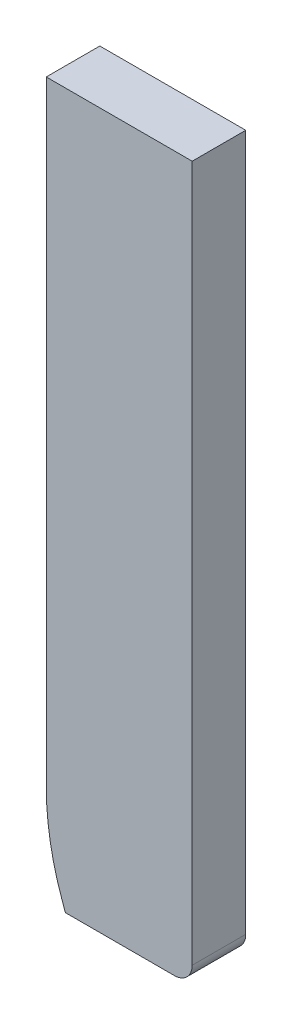
ISO-10303-21;
HEADER;
FILE_DESCRIPTION(('STEP AP214'),'2;1');
FILE_NAME('part.step','',(''),(''),'','','');
FILE_SCHEMA(('AUTOMOTIVE_DESIGN { 1 0 10303 214 1 1 1 1 }'));
ENDSEC;
DATA;
#1=APPLICATION_CONTEXT('core data for automotive mechanical design processes');
#2=APPLICATION_PROTOCOL_DEFINITION('international standard','automotive_design',2000,#1);
#3=PRODUCT_CONTEXT('',#1,'mechanical');
#4=PRODUCT('Part','Part','',(#3));
#5=PRODUCT_RELATED_PRODUCT_CATEGORY('part','',(#4));
#6=PRODUCT_DEFINITION_FORMATION('','',#4);
#7=PRODUCT_DEFINITION_CONTEXT('part definition',#1,'design');
#8=PRODUCT_DEFINITION('design','',#6,#7);
#9=PRODUCT_DEFINITION_SHAPE('','',#8);
#10=(LENGTH_UNIT() NAMED_UNIT(*) SI_UNIT(.MILLI.,.METRE.));
#11=(NAMED_UNIT(*) PLANE_ANGLE_UNIT() SI_UNIT($,.RADIAN.));
#12=(NAMED_UNIT(*) SI_UNIT($,.STERADIAN.) SOLID_ANGLE_UNIT());
#13=UNCERTAINTY_MEASURE_WITH_UNIT(LENGTH_MEASURE(1.E-05),#10,'distance_accuracy_value','');
#14=(GEOMETRIC_REPRESENTATION_CONTEXT(3) GLOBAL_UNCERTAINTY_ASSIGNED_CONTEXT((#13)) GLOBAL_UNIT_ASSIGNED_CONTEXT((#10,
#11,#12)) REPRESENTATION_CONTEXT('',''));
#15=CARTESIAN_POINT('',(0.,0.,0.));
#16=DIRECTION('',(0.,0.,1.));
#17=DIRECTION('',(1.,0.,0.));
#18=AXIS2_PLACEMENT_3D('',#15,#16,#17);
#19=CARTESIAN_POINT('',(42.8696113676581,31.0262062419554,3.));
#20=DIRECTION('',(0.,0.,-1.));
#21=DIRECTION('',(-1.,0.,0.));
#22=AXIS2_PLACEMENT_3D('',#19,#20,#21);
#23=CYLINDRICAL_SURFACE('',#22,15.0000000000003);
#24=CARTESIAN_POINT('',(42.8696113676581,31.0262062419554,0.));
#25=DIRECTION('',(0.,0.,1.));
#26=DIRECTION('',(1.,0.,0.));
#27=AXIS2_PLACEMENT_3D('',#24,#25,#26);
#28=CIRCLE('',#27,15.0000000000003);
#29=CARTESIAN_POINT('',(27.8696113676578,31.0262062419555,0.));
#30=VERTEX_POINT('',#29);
#31=CARTESIAN_POINT('',(28.7434826937352,25.9811602869831,0.));
#32=VERTEX_POINT('',#31);
#33=EDGE_CURVE('E123',#30,#32,#28,.T.);
#34=ORIENTED_EDGE('',*,*,#33,.T.);
#35=DIRECTION('',(0.,0.,-1.));
#36=VECTOR('',#35,1.);
#37=CARTESIAN_POINT('',(28.7434826937352,25.9811602869831,3.));
#38=LINE('',#37,#36);
#39=CARTESIAN_POINT('',(28.7434826937352,25.9811602869831,3.));
#40=VERTEX_POINT('',#39);
#41=EDGE_CURVE('E11',#40,#32,#38,.T.);
#42=ORIENTED_EDGE('',*,*,#41,.F.);
#43=CARTESIAN_POINT('',(42.8696113676581,31.0262062419554,3.));
#44=DIRECTION('',(0.,0.,1.));
#45=DIRECTION('',(1.,0.,0.));
#46=AXIS2_PLACEMENT_3D('',#43,#44,#45);
#47=CIRCLE('',#46,15.0000000000003);
#48=CARTESIAN_POINT('',(27.8696113676578,31.0262062419555,3.));
#49=VERTEX_POINT('',#48);
#50=EDGE_CURVE('E137',#49,#40,#47,.T.);
#51=ORIENTED_EDGE('',*,*,#50,.F.);
#52=DIRECTION('',(0.,0.,-1.));
#53=VECTOR('',#52,1.);
#54=CARTESIAN_POINT('',(27.8696113676578,31.0262062419555,3.));
#55=LINE('',#54,#53);
#56=EDGE_CURVE('E119',#49,#30,#55,.T.);
#57=ORIENTED_EDGE('',*,*,#56,.T.);
#58=EDGE_LOOP('',(#34,#42,#51,#57));
#59=FACE_BOUND('',#58,.T.);
#60=ADVANCED_FACE('F33',(#59),#23,.T.);
#61=CARTESIAN_POINT('',(28.9410399390864,25.428,3.));
#62=DIRECTION('',(0.941741911594821,0.336336396998201,0.));
#63=DIRECTION('',(-0.336336396998202,0.941741911594821,0.));
#64=AXIS2_PLACEMENT_3D('',#61,#62,#63);
#65=PLANE('',#64);
#66=DIRECTION('',(0.336336396998202,-0.941741911594821,0.));
#67=VECTOR('',#66,1.);
#68=CARTESIAN_POINT('',(28.9410399390864,25.428,0.));
#69=LINE('',#68,#67);
#70=CARTESIAN_POINT('',(28.9410399390864,25.428,0.));
#71=VERTEX_POINT('',#70);
#72=EDGE_CURVE('E126',#32,#71,#69,.T.);
#73=ORIENTED_EDGE('',*,*,#72,.T.);
#74=DIRECTION('',(0.,0.,-1.));
#75=VECTOR('',#74,1.);
#76=CARTESIAN_POINT('',(28.9410399390864,25.428,3.));
#77=LINE('',#76,#75);
#78=CARTESIAN_POINT('',(28.9410399390864,25.428,3.));
#79=VERTEX_POINT('',#78);
#80=EDGE_CURVE('E41',#79,#71,#77,.T.);
#81=ORIENTED_EDGE('',*,*,#80,.F.);
#82=DIRECTION('',(0.336336396998202,-0.941741911594821,0.));
#83=VECTOR('',#82,1.);
#84=CARTESIAN_POINT('',(28.9410399390864,25.428,3.));
#85=LINE('',#84,#83);
#86=EDGE_CURVE('E87',#40,#79,#85,.T.);
#87=ORIENTED_EDGE('',*,*,#86,.F.);
#88=ORIENTED_EDGE('',*,*,#41,.T.);
#89=EDGE_LOOP('',(#73,#81,#87,#88));
#90=FACE_BOUND('',#89,.T.);
#91=ADVANCED_FACE('F160',(#90),#65,.F.);
#92=CARTESIAN_POINT('',(35.0423886323423,25.428,3.));
#93=DIRECTION('',(0.,1.,0.));
#94=DIRECTION('',(0.,0.,1.));
#95=AXIS2_PLACEMENT_3D('',#92,#93,#94);
#96=PLANE('',#95);
#97=DIRECTION('',(1.,0.,0.));
#98=VECTOR('',#97,1.);
#99=CARTESIAN_POINT('',(35.0423886323423,25.428,0.));
#100=LINE('',#99,#98);
#101=CARTESIAN_POINT('',(35.0423886323423,25.428,0.));
#102=VERTEX_POINT('',#101);
#103=EDGE_CURVE('E128',#71,#102,#100,.T.);
#104=ORIENTED_EDGE('',*,*,#103,.T.);
#105=DIRECTION('',(0.,0.,-1.));
#106=VECTOR('',#105,1.);
#107=CARTESIAN_POINT('',(35.0423886323423,25.428,3.));
#108=LINE('',#107,#106);
#109=CARTESIAN_POINT('',(35.0423886323423,25.428,3.));
#110=VERTEX_POINT('',#109);
#111=EDGE_CURVE('E141',#110,#102,#108,.T.);
#112=ORIENTED_EDGE('',*,*,#111,.F.);
#113=DIRECTION('',(1.,0.,0.));
#114=VECTOR('',#113,1.);
#115=CARTESIAN_POINT('',(35.0423886323423,25.428,3.));
#116=LINE('',#115,#114);
#117=EDGE_CURVE('E149',#79,#110,#116,.T.);
#118=ORIENTED_EDGE('',*,*,#117,.F.);
#119=ORIENTED_EDGE('',*,*,#80,.T.);
#120=EDGE_LOOP('',(#104,#112,#118,#119));
#121=FACE_BOUND('',#120,.T.);
#122=ADVANCED_FACE('F147',(#121),#96,.F.);
#123=CARTESIAN_POINT('',(35.0423886323423,26.428,3.));
#124=DIRECTION('',(0.,0.,-1.));
#125=DIRECTION('',(-1.,0.,0.));
#126=AXIS2_PLACEMENT_3D('',#123,#124,#125);
#127=CYLINDRICAL_SURFACE('',#126,1.00000000000001);
#128=CARTESIAN_POINT('',(35.0423886323423,26.428,0.));
#129=DIRECTION('',(0.,0.,1.));
#130=DIRECTION('',(1.,0.,0.));
#131=AXIS2_PLACEMENT_3D('',#128,#129,#130);
#132=CIRCLE('',#131,1.00000000000001);
#133=CARTESIAN_POINT('',(36.0423886323423,26.428,0.));
#134=VERTEX_POINT('',#133);
#135=EDGE_CURVE('E130',#102,#134,#132,.T.);
#136=ORIENTED_EDGE('',*,*,#135,.T.);
#137=DIRECTION('',(0.,0.,-1.));
#138=VECTOR('',#137,1.);
#139=CARTESIAN_POINT('',(36.0423886323423,26.428,3.));
#140=LINE('',#139,#138);
#141=CARTESIAN_POINT('',(36.0423886323423,26.428,3.));
#142=VERTEX_POINT('',#141);
#143=EDGE_CURVE('E114',#142,#134,#140,.T.);
#144=ORIENTED_EDGE('',*,*,#143,.F.);
#145=CARTESIAN_POINT('',(35.0423886323423,26.428,3.));
#146=DIRECTION('',(0.,0.,1.));
#147=DIRECTION('',(1.,0.,0.));
#148=AXIS2_PLACEMENT_3D('',#145,#146,#147);
#149=CIRCLE('',#148,1.00000000000001);
#150=EDGE_CURVE('E104',#110,#142,#149,.T.);
#151=ORIENTED_EDGE('',*,*,#150,.F.);
#152=ORIENTED_EDGE('',*,*,#111,.T.);
#153=EDGE_LOOP('',(#136,#144,#151,#152));
#154=FACE_BOUND('',#153,.T.);
#155=ADVANCED_FACE('F153',(#154),#127,.T.);
#156=CARTESIAN_POINT('',(36.0423886323423,65.428,3.));
#157=DIRECTION('',(-1.,0.,0.));
#158=DIRECTION('',(0.,0.,1.));
#159=AXIS2_PLACEMENT_3D('',#156,#157,#158);
#160=PLANE('',#159);
#161=DIRECTION('',(0.,1.,0.));
#162=VECTOR('',#161,1.);
#163=CARTESIAN_POINT('',(36.0423886323423,65.428,0.));
#164=LINE('',#163,#162);
#165=CARTESIAN_POINT('',(36.0423886323423,65.428,0.));
#166=VERTEX_POINT('',#165);
#167=EDGE_CURVE('E112',#134,#166,#164,.T.);
#168=ORIENTED_EDGE('',*,*,#167,.T.);
#169=DIRECTION('',(0.,0.,-1.));
#170=VECTOR('',#169,1.);
#171=CARTESIAN_POINT('',(36.0423886323423,65.428,3.));
#172=LINE('',#171,#170);
#173=CARTESIAN_POINT('',(36.0423886323423,65.428,3.));
#174=VERTEX_POINT('',#173);
#175=EDGE_CURVE('E110',#174,#166,#172,.T.);
#176=ORIENTED_EDGE('',*,*,#175,.F.);
#177=DIRECTION('',(0.,1.,0.));
#178=VECTOR('',#177,1.);
#179=CARTESIAN_POINT('',(36.0423886323423,45.928,3.));
#180=LINE('',#179,#178);
#181=EDGE_CURVE('E97',#142,#174,#180,.T.);
#182=ORIENTED_EDGE('',*,*,#181,.F.);
#183=ORIENTED_EDGE('',*,*,#143,.T.);
#184=EDGE_LOOP('',(#168,#176,#182,#183));
#185=FACE_BOUND('',#184,.T.);
#186=ADVANCED_FACE('F111',(#185),#160,.F.);
#187=CARTESIAN_POINT('',(27.8696113676578,65.428,3.));
#188=DIRECTION('',(0.,-1.,0.));
#189=DIRECTION('',(0.,0.,-1.));
#190=AXIS2_PLACEMENT_3D('',#187,#188,#189);
#191=PLANE('',#190);
#192=DIRECTION('',(-1.,0.,0.));
#193=VECTOR('',#192,1.);
#194=CARTESIAN_POINT('',(27.8696113676578,65.428,0.));
#195=LINE('',#194,#193);
#196=CARTESIAN_POINT('',(27.8696113676578,65.428,0.));
#197=VERTEX_POINT('',#196);
#198=EDGE_CURVE('E134',#166,#197,#195,.T.);
#199=ORIENTED_EDGE('',*,*,#198,.T.);
#200=DIRECTION('',(0.,0.,-1.));
#201=VECTOR('',#200,1.);
#202=CARTESIAN_POINT('',(27.8696113676578,65.428,3.));
#203=LINE('',#202,#201);
#204=CARTESIAN_POINT('',(27.8696113676578,65.428,3.));
#205=VERTEX_POINT('',#204);
#206=EDGE_CURVE('E115',#205,#197,#203,.T.);
#207=ORIENTED_EDGE('',*,*,#206,.F.);
#208=DIRECTION('',(-1.,0.,0.));
#209=VECTOR('',#208,1.);
#210=CARTESIAN_POINT('',(27.8696113676578,65.428,3.));
#211=LINE('',#210,#209);
#212=EDGE_CURVE('E101',#174,#205,#211,.T.);
#213=ORIENTED_EDGE('',*,*,#212,.F.);
#214=ORIENTED_EDGE('',*,*,#175,.T.);
#215=EDGE_LOOP('',(#199,#207,#213,#214));
#216=FACE_BOUND('',#215,.T.);
#217=ADVANCED_FACE('F117',(#216),#191,.F.);
#218=CARTESIAN_POINT('',(27.8696113676578,31.0262062419555,3.));
#219=DIRECTION('',(1.,0.,0.));
#220=DIRECTION('',(0.,0.,-1.));
#221=AXIS2_PLACEMENT_3D('',#218,#219,#220);
#222=PLANE('',#221);
#223=DIRECTION('',(0.,-1.,0.));
#224=VECTOR('',#223,1.);
#225=CARTESIAN_POINT('',(27.8696113676578,31.0262062419555,0.));
#226=LINE('',#225,#224);
#227=EDGE_CURVE('E75',#197,#30,#226,.T.);
#228=ORIENTED_EDGE('',*,*,#227,.T.);
#229=ORIENTED_EDGE('',*,*,#56,.F.);
#230=DIRECTION('',(0.,-1.,0.));
#231=VECTOR('',#230,1.);
#232=CARTESIAN_POINT('',(27.8696113676578,50.4279999999998,3.));
#233=LINE('',#232,#231);
#234=EDGE_CURVE('E49',#205,#49,#233,.T.);
#235=ORIENTED_EDGE('',*,*,#234,.F.);
#236=ORIENTED_EDGE('',*,*,#206,.T.);
#237=EDGE_LOOP('',(#228,#229,#235,#236));
#238=FACE_BOUND('',#237,.T.);
#239=ADVANCED_FACE('F174',(#238),#222,.F.);
#240=CARTESIAN_POINT('',(42.8696113676581,31.0262062419554,3.));
#241=DIRECTION('',(0.,0.,1.));
#242=DIRECTION('',(1.,0.,0.));
#243=AXIS2_PLACEMENT_3D('',#240,#241,#242);
#244=PLANE('',#243);
#245=ORIENTED_EDGE('',*,*,#50,.T.);
#246=ORIENTED_EDGE('',*,*,#86,.T.);
#247=ORIENTED_EDGE('',*,*,#117,.T.);
#248=ORIENTED_EDGE('',*,*,#150,.T.);
#249=ORIENTED_EDGE('',*,*,#181,.T.);
#250=ORIENTED_EDGE('',*,*,#212,.T.);
#251=ORIENTED_EDGE('',*,*,#234,.T.);
#252=EDGE_LOOP('',(#245,#246,#247,#248,#249,#250,#251));
#253=FACE_BOUND('',#252,.T.);
#254=ADVANCED_FACE('F99',(#253),#244,.T.);
#255=CARTESIAN_POINT('',(42.8696113676581,31.0262062419554,0.));
#256=DIRECTION('',(0.,0.,1.));
#257=DIRECTION('',(1.,0.,0.));
#258=AXIS2_PLACEMENT_3D('',#255,#256,#257);
#259=PLANE('',#258);
#260=ORIENTED_EDGE('',*,*,#33,.F.);
#261=ORIENTED_EDGE('',*,*,#227,.F.);
#262=ORIENTED_EDGE('',*,*,#198,.F.);
#263=ORIENTED_EDGE('',*,*,#167,.F.);
#264=ORIENTED_EDGE('',*,*,#135,.F.);
#265=ORIENTED_EDGE('',*,*,#103,.F.);
#266=ORIENTED_EDGE('',*,*,#72,.F.);
#267=EDGE_LOOP('',(#260,#261,#262,#263,#264,#265,#266));
#268=FACE_BOUND('',#267,.T.);
#269=ADVANCED_FACE('F151',(#268),#259,.F.);
#270=CLOSED_SHELL('',(#60,#91,#122,#155,#186,#217,#239,#254,#269));
#271=MANIFOLD_SOLID_BREP('B2',#270);
#272=ADVANCED_BREP_SHAPE_REPRESENTATION('',(#18,#271),#14);
#273=SHAPE_DEFINITION_REPRESENTATION(#9,#272);
ENDSEC;
END-ISO-10303-21;
